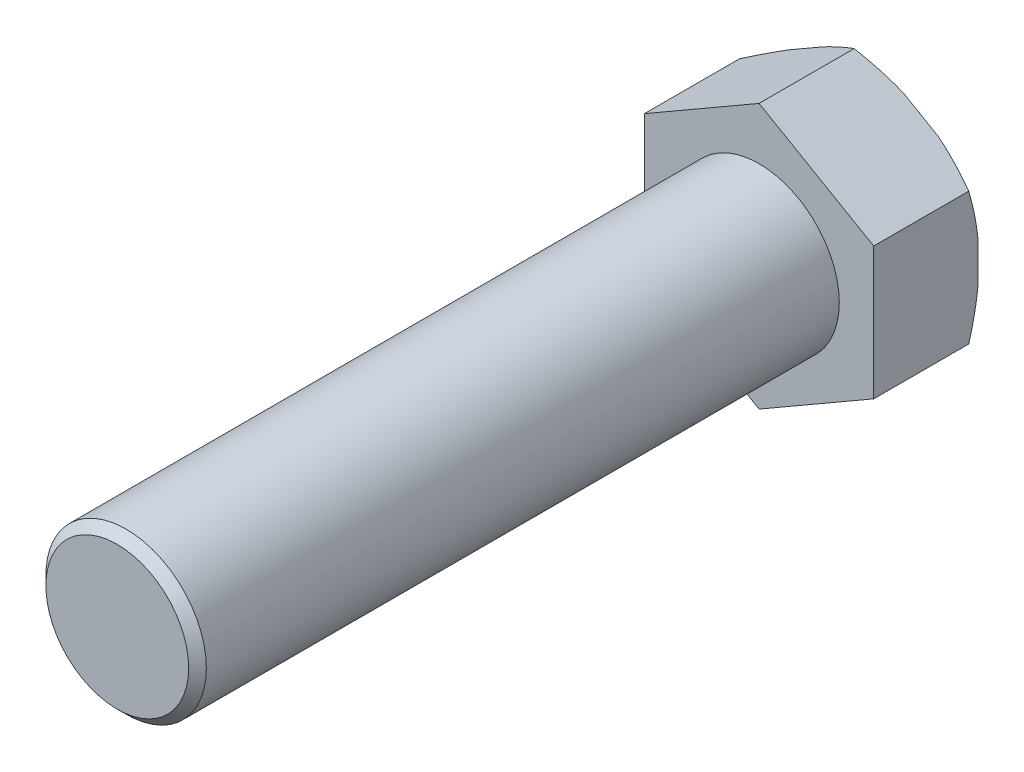
ISO-10303-21;
HEADER;
FILE_DESCRIPTION(('STEP AP214'),'2;1');
FILE_NAME('part.step','',(''),(''),'','','');
FILE_SCHEMA(('AUTOMOTIVE_DESIGN { 1 0 10303 214 1 1 1 1 }'));
ENDSEC;
DATA;
#1=APPLICATION_CONTEXT('core data for automotive mechanical design processes');
#2=APPLICATION_PROTOCOL_DEFINITION('international standard','automotive_design',2000,#1);
#3=PRODUCT_CONTEXT('',#1,'mechanical');
#4=PRODUCT('Part','Part','',(#3));
#5=PRODUCT_RELATED_PRODUCT_CATEGORY('part','',(#4));
#6=PRODUCT_DEFINITION_FORMATION('','',#4);
#7=PRODUCT_DEFINITION_CONTEXT('part definition',#1,'design');
#8=PRODUCT_DEFINITION('design','',#6,#7);
#9=PRODUCT_DEFINITION_SHAPE('','',#8);
#10=(LENGTH_UNIT() NAMED_UNIT(*) SI_UNIT(.MILLI.,.METRE.));
#11=(NAMED_UNIT(*) PLANE_ANGLE_UNIT() SI_UNIT($,.RADIAN.));
#12=(NAMED_UNIT(*) SI_UNIT($,.STERADIAN.) SOLID_ANGLE_UNIT());
#13=UNCERTAINTY_MEASURE_WITH_UNIT(LENGTH_MEASURE(1.E-05),#10,'distance_accuracy_value','');
#14=(GEOMETRIC_REPRESENTATION_CONTEXT(3) GLOBAL_UNCERTAINTY_ASSIGNED_CONTEXT((#13)) GLOBAL_UNIT_ASSIGNED_CONTEXT((#10,
#11,#12)) REPRESENTATION_CONTEXT('',''));
#15=CARTESIAN_POINT('',(0.,0.,0.));
#16=DIRECTION('',(0.,0.,1.));
#17=DIRECTION('',(1.,0.,0.));
#18=AXIS2_PLACEMENT_3D('',#15,#16,#17);
#19=CARTESIAN_POINT('',(14.2894191624432,-8.24999999999999,-13.));
#20=DIRECTION('',(1.,0.,0.));
#21=DIRECTION('',(0.,1.,0.));
#22=AXIS2_PLACEMENT_3D('',#19,#20,#21);
#23=PLANE('',#22);
#24=DIRECTION('',(0.,0.,1.));
#25=VECTOR('',#24,1.);
#26=CARTESIAN_POINT('',(14.2894191624432,-8.24999999999999,-13.));
#27=LINE('',#26,#25);
#28=CARTESIAN_POINT('',(14.2894191624432,-8.24999999999999,-11.8452994616208));
#29=VERTEX_POINT('',#28);
#30=CARTESIAN_POINT('',(14.2894191624432,-8.24999999999999,0.));
#31=VERTEX_POINT('',#30);
#32=EDGE_CURVE('E193',#29,#31,#27,.T.);
#33=ORIENTED_EDGE('',*,*,#32,.F.);
#34=CARTESIAN_POINT('',(14.2894191624432,-18.7387652021618,-7.76607975398711));
#35=CARTESIAN_POINT('',(14.2894191624432,-18.4792481958677,-7.88522117315785));
#36=CARTESIAN_POINT('',(14.2894191624432,-18.2193881951571,-8.00361491429853));
#37=CARTESIAN_POINT('',(14.2894191624432,-17.69892122803,-8.23875704335631));
#38=CARTESIAN_POINT('',(14.2894191624432,-17.4383142525987,-8.35550541131488));
#39=CARTESIAN_POINT('',(14.2894191624432,-16.6552124887015,-8.70308792501919));
#40=CARTESIAN_POINT('',(14.2894191624432,-16.1315147365886,-8.93122362255088));
#41=CARTESIAN_POINT('',(14.2894191624432,-15.0784167142339,-9.37964803594755));
#42=CARTESIAN_POINT('',(14.2894191624432,-14.549002355551,-9.59990374393489));
#43=CARTESIAN_POINT('',(14.2894191624432,-13.4858661325858,-10.0297381671741));
#44=CARTESIAN_POINT('',(14.2894191624432,-12.9521444491241,-10.2393173279523));
#45=CARTESIAN_POINT('',(14.2894191624432,-11.880920267893,-10.6449665936013));
#46=CARTESIAN_POINT('',(14.2894191624432,-11.343428759357,-10.8410655849494));
#47=CARTESIAN_POINT('',(14.2894191624432,-10.2628263574508,-11.2173131141069));
#48=CARTESIAN_POINT('',(14.2894191624432,-9.71971519032818,-11.3974608707538));
#49=CARTESIAN_POINT('',(14.2894191624432,-8.62798263136139,-11.7379772398017));
#50=CARTESIAN_POINT('',(14.2894191624432,-8.07936843613649,-11.8983687648702));
#51=CARTESIAN_POINT('',(14.2894191624432,-6.97572423925408,-12.1953402971888));
#52=CARTESIAN_POINT('',(14.2894191624432,-6.42069510998402,-12.3319235025096));
#53=CARTESIAN_POINT('',(14.2894191624432,-5.46792446808271,-12.5407153133576));
#54=CARTESIAN_POINT('',(14.2894191624432,-5.0717464190579,-12.6200601413413));
#55=CARTESIAN_POINT('',(14.2894191624432,-4.27651186315421,-12.7627987726834));
#56=CARTESIAN_POINT('',(14.2894191624432,-3.87745543656771,-12.8261930192271));
#57=CARTESIAN_POINT('',(14.2894191624432,-3.07703209269912,-12.9354562495202));
#58=CARTESIAN_POINT('',(14.2894191624432,-2.67566576758215,-12.9813295381014));
#59=CARTESIAN_POINT('',(14.2894191624432,-1.87121587658377,-13.0543036892787));
#60=CARTESIAN_POINT('',(14.2894191624432,-1.46813231718419,-13.0814046226693));
#61=CARTESIAN_POINT('',(14.2894191624432,-0.661541597898269,-13.1160033695042));
#62=CARTESIAN_POINT('',(14.2894191624432,-0.258035329781657,-13.1235217761731));
#63=CARTESIAN_POINT('',(14.2894191624432,0.548855372132328,-13.1187817464089));
#64=CARTESIAN_POINT('',(14.2894191624432,0.952239807036719,-13.1065234954325));
#65=CARTESIAN_POINT('',(14.2894191624432,1.75791897099591,-13.0626088444148));
#66=CARTESIAN_POINT('',(14.2894191624432,2.16021376705824,-13.0309536657042));
#67=CARTESIAN_POINT('',(14.2894191624432,2.96291340504315,-12.9491850013372));
#68=CARTESIAN_POINT('',(14.2894191624432,3.3633181577162,-12.8990706526811));
#69=CARTESIAN_POINT('',(14.2894191624432,4.41071922162738,-12.7450821336136));
#70=CARTESIAN_POINT('',(14.2894191624432,5.05567295036344,-12.6271754267561));
#71=CARTESIAN_POINT('',(14.2894191624432,6.33742905360714,-12.3531675431224));
#72=CARTESIAN_POINT('',(14.2894191624432,6.97422878284416,-12.1970542862204));
#73=CARTESIAN_POINT('',(14.2894191624432,8.24126323929715,-11.8533135208927));
#74=CARTESIAN_POINT('',(14.2894191624432,8.87147185325001,-11.665590860728));
#75=CARTESIAN_POINT('',(14.2894191624432,10.1238184658537,-11.2653564489423));
#76=CARTESIAN_POINT('',(14.2894191624432,10.7459572074699,-11.0528469976164));
#77=CARTESIAN_POINT('',(14.2894191624432,11.9935810388195,-10.6044819702202));
#78=CARTESIAN_POINT('',(14.2894191624432,12.6189454464009,-10.368292954633));
#79=CARTESIAN_POINT('',(14.2894191624432,13.8634198882417,-9.87993450679622));
#80=CARTESIAN_POINT('',(14.2894191624432,14.4825294485441,-9.62776387392502));
#81=CARTESIAN_POINT('',(14.2894191624432,15.7103979132632,-9.11287427281593));
#82=CARTESIAN_POINT('',(14.2894191624432,16.3192000529731,-8.85025803763731));
#83=CARTESIAN_POINT('',(14.2894191624432,17.2289995627774,-8.44888836079969));
#84=CARTESIAN_POINT('',(14.2894191624432,17.5316570109637,-8.31387683674224));
#85=CARTESIAN_POINT('',(14.2894191624432,18.135951724476,-8.04160510328658));
#86=CARTESIAN_POINT('',(14.2894191624432,18.4375890103447,-7.90434493949802));
#87=CARTESIAN_POINT('',(14.2894191624432,18.7387652021618,-7.76607975398711));
#88=B_SPLINE_CURVE_WITH_KNOTS('',3,(#34,#35,#36,#37,#38,#39,#40,#41,#42,#43,#44,#45,#46,#47,#48,
#49,#50,#51,#52,#53,#54,#55,#56,#57,#58,#59,#60,#61,#62,#63,#64,#65,#66,#67,#68,#69,#70,#71,#72,
#73,#74,#75,#76,#77,#78,#79,#80,#81,#82,#83,#84,#85,#86,#87),.UNSPECIFIED.,.F.,.F.,(4,2,2,2,2,2,
2,2,2,2,2,2,2,2,2,2,2,2,2,2,2,2,2,2,2,2,4),(0.,0.856673790365428,1.71335796333338,
3.42698348837938,5.14710201734136,6.8671487078213,8.58338656663414,10.2997084264612,
12.0140206227432,13.728102364995,14.9399577530148,16.1517794660422,17.363303247325,
18.5748224596707,19.7850671082345,20.9953004077281,22.2054575125132,23.4156712015191,
25.3810951140228,27.3471412578268,29.3192150780413,31.2911060287681,33.2962713041245,
35.3015873968393,37.2905582041573,38.2847676600243,39.2789569750303),.UNSPECIFIED.);
#89=CARTESIAN_POINT('',(14.2894191624432,-2.46221445044903,-13.));
#90=VERTEX_POINT('',#89);
#91=EDGE_CURVE('E179',#29,#90,#88,.T.);
#92=ORIENTED_EDGE('',*,*,#91,.T.);
#93=DIRECTION('',(0.,1.,0.));
#94=VECTOR('',#93,1.);
#95=CARTESIAN_POINT('',(14.2894191624432,-8.24999999999999,-13.));
#96=LINE('',#95,#94);
#97=CARTESIAN_POINT('',(14.2894191624432,2.46221445044904,-13.));
#98=VERTEX_POINT('',#97);
#99=EDGE_CURVE('E158',#90,#98,#96,.T.);
#100=ORIENTED_EDGE('',*,*,#99,.T.);
#101=CARTESIAN_POINT('',(14.2894191624432,8.25,-11.8452994616208));
#102=VERTEX_POINT('',#101);
#103=EDGE_CURVE('E140',#98,#102,#88,.T.);
#104=ORIENTED_EDGE('',*,*,#103,.T.);
#105=DIRECTION('',(0.,0.,1.));
#106=VECTOR('',#105,1.);
#107=CARTESIAN_POINT('',(14.2894191624432,8.25000000000001,-13.));
#108=LINE('',#107,#106);
#109=CARTESIAN_POINT('',(14.2894191624432,8.25000000000001,0.));
#110=VERTEX_POINT('',#109);
#111=EDGE_CURVE('E152',#102,#110,#108,.T.);
#112=ORIENTED_EDGE('',*,*,#111,.T.);
#113=DIRECTION('',(0.,1.,0.));
#114=VECTOR('',#113,1.);
#115=CARTESIAN_POINT('',(14.2894191624432,-8.24999999999999,0.));
#116=LINE('',#115,#114);
#117=EDGE_CURVE('E175',#31,#110,#116,.T.);
#118=ORIENTED_EDGE('',*,*,#117,.F.);
#119=EDGE_LOOP('',(#33,#92,#100,#104,#112,#118));
#120=FACE_BOUND('',#119,.T.);
#121=ADVANCED_FACE('F47',(#120),#23,.T.);
#122=CARTESIAN_POINT('',(0.,-16.5,-13.));
#123=DIRECTION('',(0.5,-0.866025403784439,0.));
#124=DIRECTION('',(0.866025403784439,0.5,0.));
#125=AXIS2_PLACEMENT_3D('',#122,#123,#124);
#126=PLANE('',#125);
#127=DIRECTION('',(0.,0.,1.));
#128=VECTOR('',#127,1.);
#129=CARTESIAN_POINT('',(0.,-16.5,-13.));
#130=LINE('',#129,#128);
#131=CARTESIAN_POINT('',(0.,-16.5,-11.8452994616208));
#132=VERTEX_POINT('',#131);
#133=CARTESIAN_POINT('',(0.,-16.5,0.));
#134=VERTEX_POINT('',#133);
#135=EDGE_CURVE('E195',#132,#134,#130,.T.);
#136=ORIENTED_EDGE('',*,*,#135,.F.);
#137=CARTESIAN_POINT('',(-10.4887652021618,-22.5556914129349,-7.0099006055294));
#138=CARTESIAN_POINT('',(-10.0358093086262,-22.2941772058711,-7.25702667771407));
#139=CARTESIAN_POINT('',(-9.58182230221565,-22.0320676855114,-7.50166878364269));
#140=CARTESIAN_POINT('',(-8.67135071361023,-21.5064066687405,-7.98482577666144));
#141=CARTESIAN_POINT('',(-8.21486585938505,-21.2428550152726,-8.22333997960251));
#142=CARTESIAN_POINT('',(-7.2977394437994,-20.7133518323533,-8.69370560971396));
#143=CARTESIAN_POINT('',(-6.83708967891227,-20.4473955665936,-8.92553577214083));
#144=CARTESIAN_POINT('',(-5.91248687138577,-19.9135758867747,-9.38022092547164));
#145=CARTESIAN_POINT('',(-5.44853392355387,-19.6457125274526,-9.60307617275994));
#146=CARTESIAN_POINT('',(-4.50322397866359,-19.0999375763026,-10.0441746390794));
#147=CARTESIAN_POINT('',(-4.02175344535862,-18.8219604342921,-10.2620948558608));
#148=CARTESIAN_POINT('',(-3.05409488723119,-18.2632825052736,-10.6836405226966));
#149=CARTESIAN_POINT('',(-2.5679066418333,-17.9825815909163,-10.8872653006702));
#150=CARTESIAN_POINT('',(-1.59060947831383,-17.4183388104801,-11.2766276877653));
#151=CARTESIAN_POINT('',(-1.09950517630741,-17.1347996095165,-11.4623806046198));
#152=CARTESIAN_POINT('',(-0.111540736636263,-16.5643980743226,-11.8119768899937));
#153=CARTESIAN_POINT('',(0.385318692349368,-16.2775361492483,-11.9758229255782));
#154=CARTESIAN_POINT('',(1.56565556126709,-15.5960683402442,-12.3309685065874));
#155=CARTESIAN_POINT('',(2.2518097927164,-15.1999170100113,-12.5108572930797));
#156=CARTESIAN_POINT('',(3.28856867834382,-14.6013439883096,-12.7330783794563));
#157=CARTESIAN_POINT('',(3.63539600198379,-14.4011031396438,-12.7992150884723));
#158=CARTESIAN_POINT('',(4.33123995952794,-13.9993574434417,-12.9140332460318));
#159=CARTESIAN_POINT('',(4.68025657646878,-13.7978526056992,-12.9627148296539));
#160=CARTESIAN_POINT('',(5.37546008684832,-13.39647667184,-13.0407799322218));
#161=CARTESIAN_POINT('',(5.7216269710428,-13.1966171280658,-13.0703996451872));
#162=CARTESIAN_POINT('',(6.41479453268668,-12.7964166497572,-13.1104462062525));
#163=CARTESIAN_POINT('',(6.76179519465382,-12.5960757241615,-13.1208734080184));
#164=CARTESIAN_POINT('',(7.45581496196226,-12.195383224683,-13.1222149503796));
#165=CARTESIAN_POINT('',(7.80283406630179,-11.9950316513787,-13.1131299420644));
#166=CARTESIAN_POINT('',(8.49609462209862,-11.5947774828708,-13.0757316308));
#167=CARTESIAN_POINT('',(8.84233604070888,-11.3948749066316,-13.0474175304455));
#168=CARTESIAN_POINT('',(9.63848845425403,-10.9352160963553,-12.9609503437948));
#169=CARTESIAN_POINT('',(10.0878778691846,-10.6757609966742,-12.89633829655));
#170=CARTESIAN_POINT('',(10.9828946811674,-10.1590227993467,-12.7386765013485));
#171=CARTESIAN_POINT('',(11.4285215616697,-9.90173999993057,-12.6456229119131));
#172=CARTESIAN_POINT('',(12.315714664072,-9.38951882343543,-12.4345659060645));
#173=CARTESIAN_POINT('',(12.7572766486463,-9.13458289277754,-12.3165389848193));
#174=CARTESIAN_POINT('',(13.6356887029451,-8.62743145676871,-12.0592766640486));
#175=CARTESIAN_POINT('',(14.0725388595741,-8.37521590124343,-11.9200416564018));
#176=CARTESIAN_POINT('',(14.9473755943343,-7.87012867693266,-11.6218434317006));
#177=CARTESIAN_POINT('',(15.3853015704256,-7.6172919967512,-11.4626448581691));
#178=CARTESIAN_POINT('',(16.2567861075965,-7.11414016462099,-11.129112615286));
#179=CARTESIAN_POINT('',(16.6903446359605,-6.86382503156055,-10.9547788326541));
#180=CARTESIAN_POINT('',(17.553322163336,-6.36558472382575,-10.593678391728));
#181=CARTESIAN_POINT('',(17.9827429346205,-6.11765852592903,-10.4069173543997));
#182=CARTESIAN_POINT('',(18.8380805423964,-5.62382912783158,-10.0230487347401));
#183=CARTESIAN_POINT('',(19.263997438195,-5.37792589338985,-9.82594132795166));
#184=CARTESIAN_POINT('',(20.121174824339,-4.88303429875635,-9.41913817602313));
#185=CARTESIAN_POINT('',(20.5523738905539,-4.63408140180286,-9.20927035182774));
#186=CARTESIAN_POINT('',(21.411969617523,-4.13779357744297,-8.78210693488203));
#187=CARTESIAN_POINT('',(21.8403664285961,-3.89045856324998,-8.56481174450907));
#188=CARTESIAN_POINT('',(22.6881417109765,-3.40099527575535,-8.12741314090815));
#189=CARTESIAN_POINT('',(23.1075571894935,-3.15884563633123,-7.9074051340973));
#190=CARTESIAN_POINT('',(23.9443347164219,-2.67573190590733,-7.46226898849126));
#191=CARTESIAN_POINT('',(24.3616968141886,-2.43476778641217,-7.23714097350009));
#192=CARTESIAN_POINT('',(24.778184364605,-2.19430858706509,-7.0099006055294));
#193=B_SPLINE_CURVE_WITH_KNOTS('',3,(#137,#138,#139,#140,#141,#142,#143,#144,#145,#146,#147,
#148,#149,#150,#151,#152,#153,#154,#155,#156,#157,#158,#159,#160,#161,#162,#163,#164,#165,#166,
#167,#168,#169,#170,#171,#172,#173,#174,#175,#176,#177,#178,#179,#180,#181,#182,#183,#184,#185,
#186,#187,#188,#189,#190,#191,#192),.UNSPECIFIED.,.F.,.F.,(4,2,2,2,2,2,2,2,2,2,2,2,2,2,2,2,2,2,
2,2,2,2,2,2,2,2,2,4),(0.,1.73543274326436,3.47105840410614,5.21170374110166,6.95229931815836,
8.74355376728153,10.5348923735047,12.3246827294801,14.1142549876561,16.5492497329279,
17.7666529276277,18.9840467011169,20.1860496310307,21.3880304110562,22.5899710836287,
23.7919616021498,25.3597941650261,26.9278385820571,28.4973654558314,30.0668633317289,
31.6570008265168,33.2471502237934,34.8365852071133,36.4259932318147,38.0469061080812,
39.6677313101835,41.2634891612237,42.8592084670846),.UNSPECIFIED.);
#194=CARTESIAN_POINT('',(5.01236931756764,-13.6061072252245,-13.));
#195=VERTEX_POINT('',#194);
#196=EDGE_CURVE('E224',#132,#195,#193,.T.);
#197=ORIENTED_EDGE('',*,*,#196,.T.);
#198=DIRECTION('',(0.866025403784438,0.5,0.));
#199=VECTOR('',#198,1.);
#200=CARTESIAN_POINT('',(0.,-16.5,-13.));
#201=LINE('',#200,#199);
#202=CARTESIAN_POINT('',(9.2770498448756,-11.1438927747755,-13.));
#203=VERTEX_POINT('',#202);
#204=EDGE_CURVE('E172',#195,#203,#201,.T.);
#205=ORIENTED_EDGE('',*,*,#204,.T.);
#206=EDGE_CURVE('E216',#203,#29,#193,.T.);
#207=ORIENTED_EDGE('',*,*,#206,.T.);
#208=ORIENTED_EDGE('',*,*,#32,.T.);
#209=DIRECTION('',(0.866025403784438,0.5,0.));
#210=VECTOR('',#209,1.);
#211=CARTESIAN_POINT('',(0.,-16.5,0.));
#212=LINE('',#211,#210);
#213=EDGE_CURVE('E163',#134,#31,#212,.T.);
#214=ORIENTED_EDGE('',*,*,#213,.F.);
#215=EDGE_LOOP('',(#136,#197,#205,#207,#208,#214));
#216=FACE_BOUND('',#215,.T.);
#217=ADVANCED_FACE('F213',(#216),#126,.T.);
#218=CARTESIAN_POINT('',(-14.2894191624432,-8.25,-13.));
#219=DIRECTION('',(-0.5,-0.866025403784438,0.));
#220=DIRECTION('',(0.866025403784439,-0.5,0.));
#221=AXIS2_PLACEMENT_3D('',#218,#219,#220);
#222=PLANE('',#221);
#223=DIRECTION('',(0.,0.,1.));
#224=VECTOR('',#223,1.);
#225=CARTESIAN_POINT('',(-14.2894191624432,-8.25,-13.));
#226=LINE('',#225,#224);
#227=CARTESIAN_POINT('',(-14.2894191624432,-8.25,-11.8452994616208));
#228=VERTEX_POINT('',#227);
#229=CARTESIAN_POINT('',(-14.2894191624432,-8.25,0.));
#230=VERTEX_POINT('',#229);
#231=EDGE_CURVE('E197',#228,#230,#226,.T.);
#232=ORIENTED_EDGE('',*,*,#231,.F.);
#233=CARTESIAN_POINT('',(-24.778184364605,-2.1943085870651,-7.00990060552941));
#234=CARTESIAN_POINT('',(-24.3252284710694,-2.45582279412892,-7.25702667771408));
#235=CARTESIAN_POINT('',(-23.8712414646589,-2.71793231448864,-7.5016687836427));
#236=CARTESIAN_POINT('',(-22.9607698760535,-3.24359333125948,-7.98482577666145));
#237=CARTESIAN_POINT('',(-22.5042850218283,-3.50714498472738,-8.22333997960252));
#238=CARTESIAN_POINT('',(-21.5871586062426,-4.03664816764667,-8.69370560971397));
#239=CARTESIAN_POINT('',(-21.1265088413555,-4.30260443340639,-8.92553577214083));
#240=CARTESIAN_POINT('',(-20.201906033829,-4.8364241132253,-9.38022092547165));
#241=CARTESIAN_POINT('',(-19.7379530859971,-5.10428747254737,-9.60307617275994));
#242=CARTESIAN_POINT('',(-18.7926431411068,-5.6500624236974,-10.0441746390794));
#243=CARTESIAN_POINT('',(-18.3111726078018,-5.9280395657079,-10.2620948558608));
#244=CARTESIAN_POINT('',(-17.3435140496744,-6.48671749472642,-10.6836405226966));
#245=CARTESIAN_POINT('',(-16.8573258042765,-6.76741840908372,-10.8872653006702));
#246=CARTESIAN_POINT('',(-15.8800286407571,-7.33166118951995,-11.2766276877653));
#247=CARTESIAN_POINT('',(-15.3889243387506,-7.61520039048354,-11.4623806046198));
#248=CARTESIAN_POINT('',(-14.4009598990795,-8.18560192567745,-11.8119768899937));
#249=CARTESIAN_POINT('',(-13.9041004700939,-8.47246385075171,-11.9758229255782));
#250=CARTESIAN_POINT('',(-12.7237636011761,-9.1539316597558,-12.3309685065874));
#251=CARTESIAN_POINT('',(-12.0376093697268,-9.55008298998865,-12.5108572930797));
#252=CARTESIAN_POINT('',(-11.0008504840994,-10.1486560116904,-12.7330783794563));
#253=CARTESIAN_POINT('',(-10.6540231604594,-10.3488968603562,-12.7992150884723));
#254=CARTESIAN_POINT('',(-9.95817920291528,-10.7506425565583,-12.9140332460318));
#255=CARTESIAN_POINT('',(-9.60916258597444,-10.9521473943008,-12.9627148296539));
#256=CARTESIAN_POINT('',(-8.9139590755949,-11.35352332816,-13.0407799322218));
#257=CARTESIAN_POINT('',(-8.56779219140043,-11.5533828719342,-13.0703996451872));
#258=CARTESIAN_POINT('',(-7.87462462975655,-11.9535833502428,-13.1104462062525));
#259=CARTESIAN_POINT('',(-7.5276239677894,-12.1539242758385,-13.1208734080184));
#260=CARTESIAN_POINT('',(-6.83360420048096,-12.554616775317,-13.1222149503796));
#261=CARTESIAN_POINT('',(-6.48658509614144,-12.7549683486213,-13.1131299420644));
#262=CARTESIAN_POINT('',(-5.7933245403446,-13.1552225171292,-13.0757316308));
#263=CARTESIAN_POINT('',(-5.44708312173434,-13.3551250933684,-13.0474175304455));
#264=CARTESIAN_POINT('',(-4.6509307081892,-13.8147839036447,-12.9609503437948));
#265=CARTESIAN_POINT('',(-4.20154129325859,-14.0742390033258,-12.89633829655));
#266=CARTESIAN_POINT('',(-3.30652448127583,-14.5909772006533,-12.7386765013485));
#267=CARTESIAN_POINT('',(-2.86089760077355,-14.8482600000694,-12.645622911913));
#268=CARTESIAN_POINT('',(-1.97370449837126,-15.3604811765646,-12.4345659060645));
#269=CARTESIAN_POINT('',(-1.53214251379693,-15.6154171072225,-12.3165389848193));
#270=CARTESIAN_POINT('',(-0.653730459498125,-16.1225685432313,-12.0592766640486));
#271=CARTESIAN_POINT('',(-0.21688030286913,-16.3747840987566,-11.9200416564017));
#272=CARTESIAN_POINT('',(0.657956431891046,-16.8798713230673,-11.6218434317006));
#273=CARTESIAN_POINT('',(1.09588240798239,-17.1327080032488,-11.4626448581691));
#274=CARTESIAN_POINT('',(1.96736694515327,-17.635859835379,-11.129112615286));
#275=CARTESIAN_POINT('',(2.40092547351733,-17.8861749684395,-10.9547788326541));
#276=CARTESIAN_POINT('',(3.26390300089275,-18.3844152761743,-10.593678391728));
#277=CARTESIAN_POINT('',(3.69332377217726,-18.632341474071,-10.4069173543997));
#278=CARTESIAN_POINT('',(4.54866137995319,-19.1261708721684,-10.0230487347401));
#279=CARTESIAN_POINT('',(4.97457827575179,-19.3720741066102,-9.82594132795164));
#280=CARTESIAN_POINT('',(5.83175566189578,-19.8669657012437,-9.41913817602311));
#281=CARTESIAN_POINT('',(6.2629547281107,-20.1159185981972,-9.20927035182772));
#282=CARTESIAN_POINT('',(7.12255045507982,-20.612206422557,-8.78210693488201));
#283=CARTESIAN_POINT('',(7.55094726615286,-20.85954143675,-8.56481174450906));
#284=CARTESIAN_POINT('',(8.39872254853324,-21.3490047242447,-8.12741314090814));
#285=CARTESIAN_POINT('',(8.8181380270503,-21.5911543636688,-7.90740513409729));
#286=CARTESIAN_POINT('',(9.65491555397863,-22.0742680940927,-7.46226898849125));
#287=CARTESIAN_POINT('',(10.0722776517453,-22.3152322135878,-7.23714097350009));
#288=CARTESIAN_POINT('',(10.4887652021618,-22.5556914129349,-7.0099006055294));
#289=B_SPLINE_CURVE_WITH_KNOTS('',3,(#233,#234,#235,#236,#237,#238,#239,#240,#241,#242,#243,
#244,#245,#246,#247,#248,#249,#250,#251,#252,#253,#254,#255,#256,#257,#258,#259,#260,#261,#262,
#263,#264,#265,#266,#267,#268,#269,#270,#271,#272,#273,#274,#275,#276,#277,#278,#279,#280,#281,
#282,#283,#284,#285,#286,#287,#288),.UNSPECIFIED.,.F.,.F.,(4,2,2,2,2,2,2,2,2,2,2,2,2,2,2,2,2,2,
2,2,2,2,2,2,2,2,2,4),(0.,1.73543274326436,3.47105840410614,5.21170374110166,6.95229931815836,
8.74355376728153,10.5348923735047,12.3246827294801,14.1142549876561,16.5492497329279,
17.7666529276277,18.9840467011169,20.1860496310307,21.3880304110562,22.5899710836287,
23.7919616021498,25.3597941650261,26.9278385820571,28.4973654558314,30.0668633317289,
31.6570008265168,33.2471502237934,34.8365852071133,36.4259932318147,38.0469061080812,
39.6677313101835,41.2634891612237,42.8592084670846),.UNSPECIFIED.);
#290=CARTESIAN_POINT('',(-9.27704984487558,-11.1438927747755,-13.));
#291=VERTEX_POINT('',#290);
#292=EDGE_CURVE('E228',#228,#291,#289,.T.);
#293=ORIENTED_EDGE('',*,*,#292,.T.);
#294=DIRECTION('',(0.866025403784439,-0.5,0.));
#295=VECTOR('',#294,1.);
#296=CARTESIAN_POINT('',(-14.2894191624432,-8.25,-13.));
#297=LINE('',#296,#295);
#298=CARTESIAN_POINT('',(-5.01236931756767,-13.6061072252245,-13.));
#299=VERTEX_POINT('',#298);
#300=EDGE_CURVE('E169',#291,#299,#297,.T.);
#301=ORIENTED_EDGE('',*,*,#300,.T.);
#302=EDGE_CURVE('E227',#299,#132,#289,.T.);
#303=ORIENTED_EDGE('',*,*,#302,.T.);
#304=ORIENTED_EDGE('',*,*,#135,.T.);
#305=DIRECTION('',(0.866025403784439,-0.5,0.));
#306=VECTOR('',#305,1.);
#307=CARTESIAN_POINT('',(-14.2894191624432,-8.25,0.));
#308=LINE('',#307,#306);
#309=EDGE_CURVE('E188',#230,#134,#308,.T.);
#310=ORIENTED_EDGE('',*,*,#309,.F.);
#311=EDGE_LOOP('',(#232,#293,#301,#303,#304,#310));
#312=FACE_BOUND('',#311,.T.);
#313=ADVANCED_FACE('F275',(#312),#222,.T.);
#314=CARTESIAN_POINT('',(-14.2894191624432,8.25,-13.));
#315=DIRECTION('',(-1.,0.,0.));
#316=DIRECTION('',(0.,0.,1.));
#317=AXIS2_PLACEMENT_3D('',#314,#315,#316);
#318=PLANE('',#317);
#319=DIRECTION('',(0.,0.,1.));
#320=VECTOR('',#319,1.);
#321=CARTESIAN_POINT('',(-14.2894191624432,8.25,-13.));
#322=LINE('',#321,#320);
#323=CARTESIAN_POINT('',(-14.2894191624432,8.24999999999999,-11.8452994616208));
#324=VERTEX_POINT('',#323);
#325=CARTESIAN_POINT('',(-14.2894191624432,8.25,0.));
#326=VERTEX_POINT('',#325);
#327=EDGE_CURVE('E199',#324,#326,#322,.T.);
#328=ORIENTED_EDGE('',*,*,#327,.F.);
#329=CARTESIAN_POINT('',(-14.2894191624432,18.7387652021618,-7.76607975398711));
#330=CARTESIAN_POINT('',(-14.2894191624432,18.4792481958677,-7.88522117315786));
#331=CARTESIAN_POINT('',(-14.2894191624432,18.2193881951571,-8.00361491429854));
#332=CARTESIAN_POINT('',(-14.2894191624432,17.69892122803,-8.23875704335632));
#333=CARTESIAN_POINT('',(-14.2894191624432,17.4383142525987,-8.35550541131489));
#334=CARTESIAN_POINT('',(-14.2894191624432,16.6552124887015,-8.7030879250192));
#335=CARTESIAN_POINT('',(-14.2894191624432,16.1315147365886,-8.93122362255088));
#336=CARTESIAN_POINT('',(-14.2894191624432,15.0784167142339,-9.37964803594755));
#337=CARTESIAN_POINT('',(-14.2894191624432,14.549002355551,-9.5999037439349));
#338=CARTESIAN_POINT('',(-14.2894191624432,13.4858661325857,-10.0297381671741));
#339=CARTESIAN_POINT('',(-14.2894191624432,12.9521444491241,-10.2393173279524));
#340=CARTESIAN_POINT('',(-14.2894191624432,11.880920267893,-10.6449665936014));
#341=CARTESIAN_POINT('',(-14.2894191624432,11.343428759357,-10.8410655849494));
#342=CARTESIAN_POINT('',(-14.2894191624432,10.2628263574508,-11.2173131141069));
#343=CARTESIAN_POINT('',(-14.2894191624432,9.71971519032817,-11.3974608707538));
#344=CARTESIAN_POINT('',(-14.2894191624432,8.62798263136139,-11.7379772398017));
#345=CARTESIAN_POINT('',(-14.2894191624432,8.07936843613648,-11.8983687648702));
#346=CARTESIAN_POINT('',(-14.2894191624432,6.97572423925407,-12.1953402971888));
#347=CARTESIAN_POINT('',(-14.2894191624432,6.42069510998401,-12.3319235025096));
#348=CARTESIAN_POINT('',(-14.2894191624432,5.46792446808269,-12.5407153133576));
#349=CARTESIAN_POINT('',(-14.2894191624432,5.07174641905789,-12.6200601413413));
#350=CARTESIAN_POINT('',(-14.2894191624432,4.27651186315419,-12.7627987726835));
#351=CARTESIAN_POINT('',(-14.2894191624432,3.8774554365677,-12.8261930192271));
#352=CARTESIAN_POINT('',(-14.2894191624432,3.07703209269911,-12.9354562495202));
#353=CARTESIAN_POINT('',(-14.2894191624432,2.67566576758213,-12.9813295381014));
#354=CARTESIAN_POINT('',(-14.2894191624432,1.87121587658376,-13.0543036892787));
#355=CARTESIAN_POINT('',(-14.2894191624432,1.46813231718418,-13.0814046226693));
#356=CARTESIAN_POINT('',(-14.2894191624432,0.661541597898255,-13.1160033695042));
#357=CARTESIAN_POINT('',(-14.2894191624432,0.258035329781643,-13.1235217761731));
#358=CARTESIAN_POINT('',(-14.2894191624432,-0.548855372132345,-13.1187817464089));
#359=CARTESIAN_POINT('',(-14.2894191624432,-0.952239807036737,-13.1065234954325));
#360=CARTESIAN_POINT('',(-14.2894191624432,-1.75791897099593,-13.0626088444148));
#361=CARTESIAN_POINT('',(-14.2894191624432,-2.16021376705826,-13.0309536657042));
#362=CARTESIAN_POINT('',(-14.2894191624432,-2.96291340504317,-12.9491850013372));
#363=CARTESIAN_POINT('',(-14.2894191624432,-3.36331815771622,-12.8990706526811));
#364=CARTESIAN_POINT('',(-14.2894191624432,-4.4107192216274,-12.7450821336135));
#365=CARTESIAN_POINT('',(-14.2894191624432,-5.05567295036346,-12.6271754267561));
#366=CARTESIAN_POINT('',(-14.2894191624432,-6.33742905360716,-12.3531675431224));
#367=CARTESIAN_POINT('',(-14.2894191624432,-6.97422878284418,-12.1970542862203));
#368=CARTESIAN_POINT('',(-14.2894191624432,-8.24126323929717,-11.8533135208927));
#369=CARTESIAN_POINT('',(-14.2894191624432,-8.87147185325003,-11.665590860728));
#370=CARTESIAN_POINT('',(-14.2894191624432,-10.1238184658537,-11.2653564489423));
#371=CARTESIAN_POINT('',(-14.2894191624432,-10.7459572074699,-11.0528469976164));
#372=CARTESIAN_POINT('',(-14.2894191624432,-11.9935810388195,-10.6044819702202));
#373=CARTESIAN_POINT('',(-14.2894191624432,-12.6189454464009,-10.3682929546329));
#374=CARTESIAN_POINT('',(-14.2894191624432,-13.8634198882417,-9.87993450679621));
#375=CARTESIAN_POINT('',(-14.2894191624432,-14.4825294485441,-9.62776387392501));
#376=CARTESIAN_POINT('',(-14.2894191624432,-15.7103979132632,-9.11287427281593));
#377=CARTESIAN_POINT('',(-14.2894191624432,-16.3192000529731,-8.8502580376373));
#378=CARTESIAN_POINT('',(-14.2894191624432,-17.2289995627774,-8.44888836079968));
#379=CARTESIAN_POINT('',(-14.2894191624432,-17.5316570109637,-8.31387683674224));
#380=CARTESIAN_POINT('',(-14.2894191624432,-18.1359517244759,-8.04160510328658));
#381=CARTESIAN_POINT('',(-14.2894191624432,-18.4375890103447,-7.90434493949802));
#382=CARTESIAN_POINT('',(-14.2894191624432,-18.7387652021618,-7.7660797539871));
#383=B_SPLINE_CURVE_WITH_KNOTS('',3,(#329,#330,#331,#332,#333,#334,#335,#336,#337,#338,#339,
#340,#341,#342,#343,#344,#345,#346,#347,#348,#349,#350,#351,#352,#353,#354,#355,#356,#357,#358,
#359,#360,#361,#362,#363,#364,#365,#366,#367,#368,#369,#370,#371,#372,#373,#374,#375,#376,#377,
#378,#379,#380,#381,#382),.UNSPECIFIED.,.F.,.F.,(4,2,2,2,2,2,2,2,2,2,2,2,2,2,2,2,2,2,2,2,2,2,2,
2,2,2,4),(0.,0.856673790365432,1.71335796333339,3.42698348837939,5.14710201734136,
6.86714870782131,8.58338656663415,10.2997084264612,12.0140206227432,13.728102364995,
14.9399577530148,16.1517794660422,17.363303247325,18.5748224596707,19.7850671082345,
20.9953004077281,22.2054575125132,23.4156712015192,25.3810951140228,27.3471412578268,
29.3192150780413,31.2911060287681,33.2962713041245,35.3015873968393,37.2905582041573,
38.2847676600243,39.2789569750303),.UNSPECIFIED.);
#384=CARTESIAN_POINT('',(-14.2894191624432,2.46221445044901,-13.));
#385=VERTEX_POINT('',#384);
#386=EDGE_CURVE('E264',#324,#385,#383,.T.);
#387=ORIENTED_EDGE('',*,*,#386,.T.);
#388=DIRECTION('',(0.,-1.,0.));
#389=VECTOR('',#388,1.);
#390=CARTESIAN_POINT('',(-14.2894191624432,8.25,-13.));
#391=LINE('',#390,#389);
#392=CARTESIAN_POINT('',(-14.2894191624432,-2.462214450449,-13.));
#393=VERTEX_POINT('',#392);
#394=EDGE_CURVE('E161',#385,#393,#391,.T.);
#395=ORIENTED_EDGE('',*,*,#394,.T.);
#396=EDGE_CURVE('E270',#393,#228,#383,.T.);
#397=ORIENTED_EDGE('',*,*,#396,.T.);
#398=ORIENTED_EDGE('',*,*,#231,.T.);
#399=DIRECTION('',(0.,-1.,0.));
#400=VECTOR('',#399,1.);
#401=CARTESIAN_POINT('',(-14.2894191624432,8.25,0.));
#402=LINE('',#401,#400);
#403=EDGE_CURVE('E185',#326,#230,#402,.T.);
#404=ORIENTED_EDGE('',*,*,#403,.F.);
#405=EDGE_LOOP('',(#328,#387,#395,#397,#398,#404));
#406=FACE_BOUND('',#405,.T.);
#407=ADVANCED_FACE('F271',(#406),#318,.T.);
#408=CARTESIAN_POINT('',(0.,16.5,-13.));
#409=DIRECTION('',(-0.5,0.866025403784438,0.));
#410=DIRECTION('',(-0.866025403784439,-0.5,0.));
#411=AXIS2_PLACEMENT_3D('',#408,#409,#410);
#412=PLANE('',#411);
#413=DIRECTION('',(0.,0.,1.));
#414=VECTOR('',#413,1.);
#415=CARTESIAN_POINT('',(0.,16.5,-13.));
#416=LINE('',#415,#414);
#417=CARTESIAN_POINT('',(0.,16.5,-11.8452994616208));
#418=VERTEX_POINT('',#417);
#419=CARTESIAN_POINT('',(0.,16.5,0.));
#420=VERTEX_POINT('',#419);
#421=EDGE_CURVE('E201',#418,#420,#416,.T.);
#422=ORIENTED_EDGE('',*,*,#421,.F.);
#423=CARTESIAN_POINT('',(10.4887652021618,22.5556914129349,-7.0099006055294));
#424=CARTESIAN_POINT('',(10.0358093086262,22.2941772058711,-7.25702667771408));
#425=CARTESIAN_POINT('',(9.58182230221565,22.0320676855114,-7.5016687836427));
#426=CARTESIAN_POINT('',(8.67135071361023,21.5064066687405,-7.98482577666145));
#427=CARTESIAN_POINT('',(8.21486585938505,21.2428550152726,-8.22333997960252));
#428=CARTESIAN_POINT('',(7.2977394437994,20.7133518323533,-8.69370560971396));
#429=CARTESIAN_POINT('',(6.83708967891227,20.4473955665936,-8.92553577214083));
#430=CARTESIAN_POINT('',(5.91248687138577,19.9135758867747,-9.38022092547165));
#431=CARTESIAN_POINT('',(5.44853392355386,19.6457125274526,-9.60307617275994));
#432=CARTESIAN_POINT('',(4.50322397866359,19.0999375763026,-10.0441746390794));
#433=CARTESIAN_POINT('',(4.02175344535861,18.8219604342921,-10.2620948558608));
#434=CARTESIAN_POINT('',(3.05409488723119,18.2632825052736,-10.6836405226966));
#435=CARTESIAN_POINT('',(2.5679066418333,17.9825815909163,-10.8872653006702));
#436=CARTESIAN_POINT('',(1.59060947831383,17.4183388104801,-11.2766276877653));
#437=CARTESIAN_POINT('',(1.0995051763074,17.1347996095165,-11.4623806046198));
#438=CARTESIAN_POINT('',(0.111540736636261,16.5643980743226,-11.8119768899937));
#439=CARTESIAN_POINT('',(-0.385318692349371,16.2775361492483,-11.9758229255782));
#440=CARTESIAN_POINT('',(-1.5656555612671,15.5960683402442,-12.3309685065874));
#441=CARTESIAN_POINT('',(-2.2518097927164,15.1999170100114,-12.5108572930797));
#442=CARTESIAN_POINT('',(-3.28856867834382,14.6013439883096,-12.7330783794563));
#443=CARTESIAN_POINT('',(-3.63539600198379,14.4011031396438,-12.7992150884723));
#444=CARTESIAN_POINT('',(-4.33123995952795,13.9993574434417,-12.9140332460318));
#445=CARTESIAN_POINT('',(-4.68025657646879,13.7978526056992,-12.9627148296539));
#446=CARTESIAN_POINT('',(-5.37546008684832,13.39647667184,-13.0407799322218));
#447=CARTESIAN_POINT('',(-5.7216269710428,13.1966171280658,-13.0703996451872));
#448=CARTESIAN_POINT('',(-6.41479453268668,12.7964166497572,-13.1104462062525));
#449=CARTESIAN_POINT('',(-6.76179519465382,12.5960757241615,-13.1208734080184));
#450=CARTESIAN_POINT('',(-7.45581496196226,12.195383224683,-13.1222149503796));
#451=CARTESIAN_POINT('',(-7.80283406630178,11.9950316513787,-13.1131299420644));
#452=CARTESIAN_POINT('',(-8.49609462209862,11.5947774828708,-13.0757316308));
#453=CARTESIAN_POINT('',(-8.84233604070888,11.3948749066316,-13.0474175304455));
#454=CARTESIAN_POINT('',(-9.63848845425403,10.9352160963553,-12.9609503437948));
#455=CARTESIAN_POINT('',(-10.0878778691846,10.6757609966742,-12.89633829655));
#456=CARTESIAN_POINT('',(-10.9828946811674,10.1590227993467,-12.7386765013485));
#457=CARTESIAN_POINT('',(-11.4285215616697,9.90173999993058,-12.6456229119131));
#458=CARTESIAN_POINT('',(-12.315714664072,9.38951882343543,-12.4345659060645));
#459=CARTESIAN_POINT('',(-12.7572766486463,9.13458289277754,-12.3165389848193));
#460=CARTESIAN_POINT('',(-13.6356887029451,8.62743145676871,-12.0592766640486));
#461=CARTESIAN_POINT('',(-14.0725388595741,8.37521590124343,-11.9200416564018));
#462=CARTESIAN_POINT('',(-14.9473755943343,7.87012867693267,-11.6218434317006));
#463=CARTESIAN_POINT('',(-15.3853015704256,7.61729199675121,-11.4626448581691));
#464=CARTESIAN_POINT('',(-16.2567861075965,7.114140164621,-11.129112615286));
#465=CARTESIAN_POINT('',(-16.6903446359605,6.86382503156055,-10.9547788326541));
#466=CARTESIAN_POINT('',(-17.553322163336,6.36558472382576,-10.5936783917281));
#467=CARTESIAN_POINT('',(-17.9827429346205,6.11765852592904,-10.4069173543997));
#468=CARTESIAN_POINT('',(-18.8380805423964,5.62382912783159,-10.0230487347401));
#469=CARTESIAN_POINT('',(-19.263997438195,5.37792589338986,-9.82594132795167));
#470=CARTESIAN_POINT('',(-20.121174824339,4.88303429875636,-9.41913817602313));
#471=CARTESIAN_POINT('',(-20.5523738905539,4.63408140180286,-9.20927035182774));
#472=CARTESIAN_POINT('',(-21.411969617523,4.13779357744298,-8.78210693488203));
#473=CARTESIAN_POINT('',(-21.8403664285961,3.89045856324998,-8.56481174450907));
#474=CARTESIAN_POINT('',(-22.6881417109765,3.40099527575535,-8.12741314090816));
#475=CARTESIAN_POINT('',(-23.1075571894935,3.15884563633123,-7.9074051340973));
#476=CARTESIAN_POINT('',(-23.9443347164219,2.67573190590733,-7.46226898849126));
#477=CARTESIAN_POINT('',(-24.3616968141886,2.43476778641218,-7.23714097350009));
#478=CARTESIAN_POINT('',(-24.7781843646051,2.19430858706509,-7.00990060552941));
#479=B_SPLINE_CURVE_WITH_KNOTS('',3,(#423,#424,#425,#426,#427,#428,#429,#430,#431,#432,#433,
#434,#435,#436,#437,#438,#439,#440,#441,#442,#443,#444,#445,#446,#447,#448,#449,#450,#451,#452,
#453,#454,#455,#456,#457,#458,#459,#460,#461,#462,#463,#464,#465,#466,#467,#468,#469,#470,#471,
#472,#473,#474,#475,#476,#477,#478),.UNSPECIFIED.,.F.,.F.,(4,2,2,2,2,2,2,2,2,2,2,2,2,2,2,2,2,2,
2,2,2,2,2,2,2,2,2,4),(0.,1.73543274326436,3.47105840410614,5.21170374110166,6.95229931815836,
8.74355376728153,10.5348923735047,12.3246827294801,14.1142549876561,16.5492497329279,
17.7666529276277,18.9840467011169,20.1860496310307,21.3880304110562,22.5899710836287,
23.7919616021498,25.3597941650261,26.9278385820571,28.4973654558314,30.0668633317289,
31.6570008265168,33.2471502237934,34.8365852071133,36.4259932318147,38.0469061080812,
39.6677313101834,41.2634891612237,42.8592084670846),.UNSPECIFIED.);
#480=CARTESIAN_POINT('',(-5.01236931756759,13.6061072252245,-13.));
#481=VERTEX_POINT('',#480);
#482=EDGE_CURVE('E153',#418,#481,#479,.T.);
#483=ORIENTED_EDGE('',*,*,#482,.T.);
#484=DIRECTION('',(-0.866025403784438,-0.5,0.));
#485=VECTOR('',#484,1.);
#486=CARTESIAN_POINT('',(0.,16.5,-13.));
#487=LINE('',#486,#485);
#488=CARTESIAN_POINT('',(-9.27704984487564,11.1438927747755,-13.));
#489=VERTEX_POINT('',#488);
#490=EDGE_CURVE('E157',#481,#489,#487,.T.);
#491=ORIENTED_EDGE('',*,*,#490,.T.);
#492=EDGE_CURVE('E70',#489,#324,#479,.T.);
#493=ORIENTED_EDGE('',*,*,#492,.T.);
#494=ORIENTED_EDGE('',*,*,#327,.T.);
#495=DIRECTION('',(-0.866025403784438,-0.5,0.));
#496=VECTOR('',#495,1.);
#497=CARTESIAN_POINT('',(0.,16.5,0.));
#498=LINE('',#497,#496);
#499=EDGE_CURVE('E182',#420,#326,#498,.T.);
#500=ORIENTED_EDGE('',*,*,#499,.F.);
#501=EDGE_LOOP('',(#422,#483,#491,#493,#494,#500));
#502=FACE_BOUND('',#501,.T.);
#503=ADVANCED_FACE('F274',(#502),#412,.T.);
#504=CARTESIAN_POINT('',(14.2894191624432,8.25000000000001,-13.));
#505=DIRECTION('',(0.5,0.866025403784439,0.));
#506=DIRECTION('',(-0.866025403784439,0.5,0.));
#507=AXIS2_PLACEMENT_3D('',#504,#505,#506);
#508=PLANE('',#507);
#509=ORIENTED_EDGE('',*,*,#111,.F.);
#510=CARTESIAN_POINT('',(24.778184364605,2.19430858706511,-7.00990060552941));
#511=CARTESIAN_POINT('',(24.3252284710694,2.45582279412892,-7.25702667771408));
#512=CARTESIAN_POINT('',(23.8712414646589,2.71793231448865,-7.5016687836427));
#513=CARTESIAN_POINT('',(22.9607698760535,3.24359333125949,-7.98482577666145));
#514=CARTESIAN_POINT('',(22.5042850218283,3.50714498472739,-8.22333997960252));
#515=CARTESIAN_POINT('',(21.5871586062426,4.03664816764668,-8.69370560971397));
#516=CARTESIAN_POINT('',(21.1265088413555,4.3026044334064,-8.92553577214084));
#517=CARTESIAN_POINT('',(20.201906033829,4.83642411322531,-9.38022092547165));
#518=CARTESIAN_POINT('',(19.7379530859971,5.10428747254738,-9.60307617275995));
#519=CARTESIAN_POINT('',(18.7926431411068,5.65006242369741,-10.0441746390794));
#520=CARTESIAN_POINT('',(18.3111726078018,5.92803956570791,-10.2620948558608));
#521=CARTESIAN_POINT('',(17.3435140496744,6.48671749472642,-10.6836405226966));
#522=CARTESIAN_POINT('',(16.8573258042765,6.76741840908372,-10.8872653006702));
#523=CARTESIAN_POINT('',(15.8800286407571,7.33166118951995,-11.2766276877653));
#524=CARTESIAN_POINT('',(15.3889243387506,7.61520039048354,-11.4623806046198));
#525=CARTESIAN_POINT('',(14.4009598990795,8.18560192567745,-11.8119768899937));
#526=CARTESIAN_POINT('',(13.9041004700939,8.47246385075171,-11.9758229255782));
#527=CARTESIAN_POINT('',(12.7237636011761,9.1539316597558,-12.3309685065874));
#528=CARTESIAN_POINT('',(12.0376093697268,9.55008298998866,-12.5108572930797));
#529=CARTESIAN_POINT('',(11.0008504840994,10.1486560116904,-12.7330783794563));
#530=CARTESIAN_POINT('',(10.6540231604594,10.3488968603562,-12.7992150884723));
#531=CARTESIAN_POINT('',(9.95817920291528,10.7506425565583,-12.9140332460318));
#532=CARTESIAN_POINT('',(9.60916258597444,10.9521473943008,-12.9627148296539));
#533=CARTESIAN_POINT('',(8.9139590755949,11.35352332816,-13.0407799322218));
#534=CARTESIAN_POINT('',(8.56779219140043,11.5533828719342,-13.0703996451872));
#535=CARTESIAN_POINT('',(7.87462462975655,11.9535833502428,-13.1104462062525));
#536=CARTESIAN_POINT('',(7.5276239677894,12.1539242758385,-13.1208734080184));
#537=CARTESIAN_POINT('',(6.83360420048097,12.554616775317,-13.1222149503796));
#538=CARTESIAN_POINT('',(6.48658509614144,12.7549683486213,-13.1131299420644));
#539=CARTESIAN_POINT('',(5.79332454034461,13.1552225171292,-13.0757316308));
#540=CARTESIAN_POINT('',(5.44708312173434,13.3551250933684,-13.0474175304455));
#541=CARTESIAN_POINT('',(4.6509307081892,13.8147839036447,-12.9609503437948));
#542=CARTESIAN_POINT('',(4.2015412932586,14.0742390033258,-12.89633829655));
#543=CARTESIAN_POINT('',(3.30652448127583,14.5909772006533,-12.7386765013485));
#544=CARTESIAN_POINT('',(2.86089760077356,14.8482600000694,-12.6456229119131));
#545=CARTESIAN_POINT('',(1.97370449837126,15.3604811765646,-12.4345659060645));
#546=CARTESIAN_POINT('',(1.53214251379694,15.6154171072225,-12.3165389848193));
#547=CARTESIAN_POINT('',(0.653730459498129,16.1225685432313,-12.0592766640486));
#548=CARTESIAN_POINT('',(0.216880302869134,16.3747840987566,-11.9200416564018));
#549=CARTESIAN_POINT('',(-0.657956431891042,16.8798713230673,-11.6218434317006));
#550=CARTESIAN_POINT('',(-1.09588240798238,17.1327080032488,-11.4626448581691));
#551=CARTESIAN_POINT('',(-1.96736694515327,17.635859835379,-11.129112615286));
#552=CARTESIAN_POINT('',(-2.40092547351733,17.8861749684395,-10.9547788326541));
#553=CARTESIAN_POINT('',(-3.26390300089275,18.3844152761743,-10.593678391728));
#554=CARTESIAN_POINT('',(-3.69332377217725,18.632341474071,-10.4069173543997));
#555=CARTESIAN_POINT('',(-4.54866137995318,19.1261708721684,-10.0230487347401));
#556=CARTESIAN_POINT('',(-4.97457827575178,19.3720741066102,-9.82594132795166));
#557=CARTESIAN_POINT('',(-5.83175566189577,19.8669657012437,-9.41913817602312));
#558=CARTESIAN_POINT('',(-6.26295472811069,20.1159185981971,-9.20927035182773));
#559=CARTESIAN_POINT('',(-7.12255045507982,20.612206422557,-8.78210693488202));
#560=CARTESIAN_POINT('',(-7.55094726615285,20.85954143675,-8.56481174450907));
#561=CARTESIAN_POINT('',(-8.39872254853324,21.3490047242446,-8.12741314090816));
#562=CARTESIAN_POINT('',(-8.8181380270503,21.5911543636688,-7.9074051340973));
#563=CARTESIAN_POINT('',(-9.65491555397862,22.0742680940927,-7.46226898849126));
#564=CARTESIAN_POINT('',(-10.0722776517453,22.3152322135878,-7.23714097350009));
#565=CARTESIAN_POINT('',(-10.4887652021618,22.5556914129349,-7.00990060552941));
#566=B_SPLINE_CURVE_WITH_KNOTS('',3,(#510,#511,#512,#513,#514,#515,#516,#517,#518,#519,#520,
#521,#522,#523,#524,#525,#526,#527,#528,#529,#530,#531,#532,#533,#534,#535,#536,#537,#538,#539,
#540,#541,#542,#543,#544,#545,#546,#547,#548,#549,#550,#551,#552,#553,#554,#555,#556,#557,#558,
#559,#560,#561,#562,#563,#564,#565),.UNSPECIFIED.,.F.,.F.,(4,2,2,2,2,2,2,2,2,2,2,2,2,2,2,2,2,2,
2,2,2,2,2,2,2,2,2,4),(0.,1.73543274326436,3.47105840410614,5.21170374110166,6.95229931815836,
8.74355376728153,10.5348923735047,12.3246827294801,14.1142549876561,16.5492497329279,
17.7666529276277,18.9840467011169,20.1860496310307,21.3880304110562,22.5899710836287,
23.7919616021498,25.3597941650261,26.9278385820571,28.4973654558314,30.0668633317289,
31.6570008265168,33.2471502237934,34.8365852071133,36.4259932318147,38.0469061080812,
39.6677313101834,41.2634891612237,42.8592084670846),.UNSPECIFIED.);
#567=CARTESIAN_POINT('',(9.27704984487562,11.1438927747755,-13.));
#568=VERTEX_POINT('',#567);
#569=EDGE_CURVE('E138',#102,#568,#566,.T.);
#570=ORIENTED_EDGE('',*,*,#569,.T.);
#571=DIRECTION('',(-0.866025403784439,0.5,0.));
#572=VECTOR('',#571,1.);
#573=CARTESIAN_POINT('',(14.2894191624432,8.25000000000001,-13.));
#574=LINE('',#573,#572);
#575=CARTESIAN_POINT('',(5.01236931756761,13.6061072252245,-13.));
#576=VERTEX_POINT('',#575);
#577=EDGE_CURVE('E150',#568,#576,#574,.T.);
#578=ORIENTED_EDGE('',*,*,#577,.T.);
#579=EDGE_CURVE('E62',#576,#418,#566,.T.);
#580=ORIENTED_EDGE('',*,*,#579,.T.);
#581=ORIENTED_EDGE('',*,*,#421,.T.);
#582=DIRECTION('',(-0.866025403784439,0.5,0.));
#583=VECTOR('',#582,1.);
#584=CARTESIAN_POINT('',(14.2894191624432,8.25000000000001,0.));
#585=LINE('',#584,#583);
#586=EDGE_CURVE('E178',#110,#420,#585,.T.);
#587=ORIENTED_EDGE('',*,*,#586,.F.);
#588=EDGE_LOOP('',(#509,#570,#578,#580,#581,#587));
#589=FACE_BOUND('',#588,.T.);
#590=ADVANCED_FACE('F149',(#589),#508,.T.);
#591=CARTESIAN_POINT('',(0.,0.,-13.));
#592=DIRECTION('',(0.,0.,1.));
#593=DIRECTION('',(1.,0.,0.));
#594=AXIS2_PLACEMENT_3D('',#591,#592,#593);
#595=PLANE('',#594);
#596=CARTESIAN_POINT('',(0.,0.,-13.));
#597=DIRECTION('',(0.,0.,1.));
#598=DIRECTION('',(1.,0.,0.));
#599=AXIS2_PLACEMENT_3D('',#596,#597,#598);
#600=CIRCLE('',#599,14.5);
#601=EDGE_CURVE('E135',#98,#568,#600,.T.);
#602=ORIENTED_EDGE('',*,*,#601,.F.);
#603=ORIENTED_EDGE('',*,*,#99,.F.);
#604=CARTESIAN_POINT('',(0.,0.,-13.));
#605=DIRECTION('',(0.,0.,1.));
#606=DIRECTION('',(1.,0.,0.));
#607=AXIS2_PLACEMENT_3D('',#604,#605,#606);
#608=CIRCLE('',#607,14.5);
#609=EDGE_CURVE('E51',#203,#90,#608,.T.);
#610=ORIENTED_EDGE('',*,*,#609,.F.);
#611=ORIENTED_EDGE('',*,*,#204,.F.);
#612=EDGE_CURVE('E223',#299,#195,#608,.T.);
#613=ORIENTED_EDGE('',*,*,#612,.F.);
#614=ORIENTED_EDGE('',*,*,#300,.F.);
#615=EDGE_CURVE('E306',#393,#291,#608,.T.);
#616=ORIENTED_EDGE('',*,*,#615,.F.);
#617=ORIENTED_EDGE('',*,*,#394,.F.);
#618=EDGE_CURVE('E56',#489,#385,#608,.T.);
#619=ORIENTED_EDGE('',*,*,#618,.F.);
#620=ORIENTED_EDGE('',*,*,#490,.F.);
#621=EDGE_CURVE('E12',#576,#481,#608,.T.);
#622=ORIENTED_EDGE('',*,*,#621,.F.);
#623=ORIENTED_EDGE('',*,*,#577,.F.);
#624=EDGE_LOOP('',(#602,#603,#610,#611,#613,#614,#616,#617,#619,#620,#622,#623));
#625=FACE_BOUND('',#624,.T.);
#626=ADVANCED_FACE('F155',(#625),#595,.F.);
#627=CARTESIAN_POINT('',(0.,0.,0.));
#628=DIRECTION('',(0.,0.,1.));
#629=DIRECTION('',(1.,0.,0.));
#630=AXIS2_PLACEMENT_3D('',#627,#628,#629);
#631=PLANE('',#630);
#632=ORIENTED_EDGE('',*,*,#117,.T.);
#633=ORIENTED_EDGE('',*,*,#586,.T.);
#634=ORIENTED_EDGE('',*,*,#499,.T.);
#635=ORIENTED_EDGE('',*,*,#403,.T.);
#636=ORIENTED_EDGE('',*,*,#309,.T.);
#637=ORIENTED_EDGE('',*,*,#213,.T.);
#638=EDGE_LOOP('',(#632,#633,#634,#635,#636,#637));
#639=FACE_BOUND('',#638,.T.);
#640=ADVANCED_FACE('F208',(#639),#631,.T.);
#641=CARTESIAN_POINT('',(0.,0.,-7.22649730810382));
#642=DIRECTION('',(0.,0.,1.));
#643=DIRECTION('',(1.,0.,0.));
#644=AXIS2_PLACEMENT_3D('',#641,#642,#643);
#645=CONICAL_SURFACE('',#644,24.5,1.0471975511966);
#646=ORIENTED_EDGE('',*,*,#206,.F.);
#647=ORIENTED_EDGE('',*,*,#609,.T.);
#648=ORIENTED_EDGE('',*,*,#91,.F.);
#649=EDGE_LOOP('',(#646,#647,#648));
#650=FACE_BOUND('',#649,.T.);
#651=ADVANCED_FACE('F247',(#650),#645,.T.);
#652=ORIENTED_EDGE('',*,*,#302,.F.);
#653=ORIENTED_EDGE('',*,*,#612,.T.);
#654=ORIENTED_EDGE('',*,*,#196,.F.);
#655=EDGE_LOOP('',(#652,#653,#654));
#656=FACE_BOUND('',#655,.T.);
#657=ADVANCED_FACE('F307',(#656),#645,.T.);
#658=ORIENTED_EDGE('',*,*,#396,.F.);
#659=ORIENTED_EDGE('',*,*,#615,.T.);
#660=ORIENTED_EDGE('',*,*,#292,.F.);
#661=EDGE_LOOP('',(#658,#659,#660));
#662=FACE_BOUND('',#661,.T.);
#663=ADVANCED_FACE('F305',(#662),#645,.T.);
#664=ORIENTED_EDGE('',*,*,#492,.F.);
#665=ORIENTED_EDGE('',*,*,#618,.T.);
#666=ORIENTED_EDGE('',*,*,#386,.F.);
#667=EDGE_LOOP('',(#664,#665,#666));
#668=FACE_BOUND('',#667,.T.);
#669=ADVANCED_FACE('F246',(#668),#645,.T.);
#670=ORIENTED_EDGE('',*,*,#579,.F.);
#671=ORIENTED_EDGE('',*,*,#621,.T.);
#672=ORIENTED_EDGE('',*,*,#482,.F.);
#673=EDGE_LOOP('',(#670,#671,#672));
#674=FACE_BOUND('',#673,.T.);
#675=ADVANCED_FACE('F242',(#674),#645,.T.);
#676=ORIENTED_EDGE('',*,*,#601,.T.);
#677=ORIENTED_EDGE('',*,*,#569,.F.);
#678=ORIENTED_EDGE('',*,*,#103,.F.);
#679=EDGE_LOOP('',(#676,#677,#678));
#680=FACE_BOUND('',#679,.T.);
#681=ADVANCED_FACE('F137',(#680),#645,.T.);
#682=CLOSED_SHELL('',(#121,#217,#313,#407,#503,#590,#626,#640,#651,#657,#663,#669,#675,#681));
#683=MANIFOLD_SOLID_BREP('B2',#682);
#684=CARTESIAN_POINT('',(0.,0.,80.));
#685=DIRECTION('',(0.,0.,-1.));
#686=DIRECTION('',(-1.,0.,0.));
#687=AXIS2_PLACEMENT_3D('',#684,#685,#686);
#688=CYLINDRICAL_SURFACE('',#687,10.);
#689=CARTESIAN_POINT('',(0.,0.,78.8985));
#690=DIRECTION('',(0.,0.,1.));
#691=DIRECTION('',(1.,0.,0.));
#692=AXIS2_PLACEMENT_3D('',#689,#690,#691);
#693=CIRCLE('',#692,10.);
#694=CARTESIAN_POINT('',(10.,0.,78.8985));
#695=VERTEX_POINT('',#694);
#696=EDGE_CURVE('E46',#695,#695,#693,.F.);
#697=ORIENTED_EDGE('',*,*,#696,.T.);
#698=EDGE_LOOP('',(#697));
#699=FACE_BOUND('',#698,.T.);
#700=CARTESIAN_POINT('',(0.,0.,0.));
#701=DIRECTION('',(0.,0.,1.));
#702=DIRECTION('',(1.,0.,0.));
#703=AXIS2_PLACEMENT_3D('',#700,#701,#702);
#704=CIRCLE('',#703,10.);
#705=CARTESIAN_POINT('',(10.,0.,0.));
#706=VERTEX_POINT('',#705);
#707=EDGE_CURVE('E405',#706,#706,#704,.T.);
#708=ORIENTED_EDGE('',*,*,#707,.T.);
#709=EDGE_LOOP('',(#708));
#710=FACE_BOUND('',#709,.T.);
#711=ADVANCED_FACE('F394',(#699,#710),#688,.T.);
#712=CARTESIAN_POINT('',(0.,0.,80.));
#713=DIRECTION('',(0.,0.,1.));
#714=DIRECTION('',(1.,0.,0.));
#715=AXIS2_PLACEMENT_3D('',#712,#713,#714);
#716=PLANE('',#715);
#717=CARTESIAN_POINT('',(0.,0.,80.));
#718=DIRECTION('',(0.,0.,1.));
#719=DIRECTION('',(1.,0.,0.));
#720=AXIS2_PLACEMENT_3D('',#717,#718,#719);
#721=CIRCLE('',#720,8.89850000000001);
#722=CARTESIAN_POINT('',(8.89850000000001,0.,80.));
#723=VERTEX_POINT('',#722);
#724=EDGE_CURVE('E401',#723,#723,#721,.T.);
#725=ORIENTED_EDGE('',*,*,#724,.T.);
#726=EDGE_LOOP('',(#725));
#727=FACE_BOUND('',#726,.T.);
#728=ADVANCED_FACE('F415',(#727),#716,.T.);
#729=CARTESIAN_POINT('',(0.,0.,0.));
#730=DIRECTION('',(0.,0.,1.));
#731=DIRECTION('',(1.,0.,0.));
#732=AXIS2_PLACEMENT_3D('',#729,#730,#731);
#733=PLANE('',#732);
#734=ORIENTED_EDGE('',*,*,#707,.F.);
#735=EDGE_LOOP('',(#734));
#736=FACE_BOUND('',#735,.T.);
#737=ADVANCED_FACE('F413',(#736),#733,.F.);
#738=CARTESIAN_POINT('',(0.,0.,80.));
#739=DIRECTION('',(0.,0.,-1.));
#740=DIRECTION('',(-1.,0.,0.));
#741=AXIS2_PLACEMENT_3D('',#738,#739,#740);
#742=CONICAL_SURFACE('',#741,8.89850000000001,0.785398163397448);
#743=ORIENTED_EDGE('',*,*,#696,.F.);
#744=EDGE_LOOP('',(#743));
#745=FACE_BOUND('',#744,.T.);
#746=ORIENTED_EDGE('',*,*,#724,.F.);
#747=EDGE_LOOP('',(#746));
#748=FACE_BOUND('',#747,.T.);
#749=ADVANCED_FACE('F396',(#745,#748),#742,.T.);
#750=CLOSED_SHELL('',(#711,#728,#737,#749));
#751=MANIFOLD_SOLID_BREP('B6',#750);
#752=ADVANCED_BREP_SHAPE_REPRESENTATION('',(#18,#683,#751),#14);
#753=SHAPE_DEFINITION_REPRESENTATION(#9,#752);
ENDSEC;
END-ISO-10303-21;
